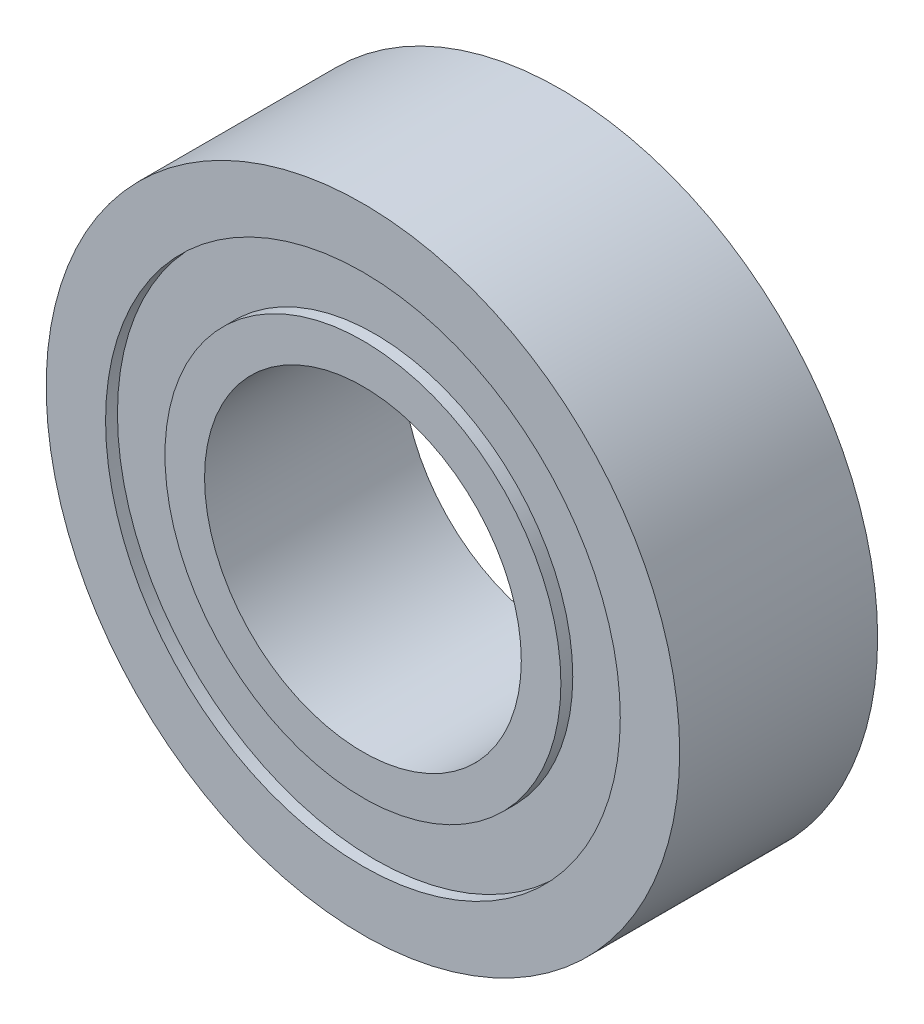
ISO-10303-21;
HEADER;
FILE_DESCRIPTION(('STEP AP214'),'2;1');
FILE_NAME('part.step','',(''),(''),'','','');
FILE_SCHEMA(('AUTOMOTIVE_DESIGN { 1 0 10303 214 1 1 1 1 }'));
ENDSEC;
DATA;
#1=APPLICATION_CONTEXT('core data for automotive mechanical design processes');
#2=APPLICATION_PROTOCOL_DEFINITION('international standard','automotive_design',2000,#1);
#3=PRODUCT_CONTEXT('',#1,'mechanical');
#4=PRODUCT('Part','Part','',(#3));
#5=PRODUCT_RELATED_PRODUCT_CATEGORY('part','',(#4));
#6=PRODUCT_DEFINITION_FORMATION('','',#4);
#7=PRODUCT_DEFINITION_CONTEXT('part definition',#1,'design');
#8=PRODUCT_DEFINITION('design','',#6,#7);
#9=PRODUCT_DEFINITION_SHAPE('','',#8);
#10=(LENGTH_UNIT() NAMED_UNIT(*) SI_UNIT(.MILLI.,.METRE.));
#11=(NAMED_UNIT(*) PLANE_ANGLE_UNIT() SI_UNIT($,.RADIAN.));
#12=(NAMED_UNIT(*) SI_UNIT($,.STERADIAN.) SOLID_ANGLE_UNIT());
#13=UNCERTAINTY_MEASURE_WITH_UNIT(LENGTH_MEASURE(1.E-05),#10,'distance_accuracy_value','');
#14=(GEOMETRIC_REPRESENTATION_CONTEXT(3) GLOBAL_UNCERTAINTY_ASSIGNED_CONTEXT((#13)) GLOBAL_UNIT_ASSIGNED_CONTEXT((#10,
#11,#12)) REPRESENTATION_CONTEXT('',''));
#15=CARTESIAN_POINT('',(0.,0.,0.));
#16=DIRECTION('',(0.,0.,1.));
#17=DIRECTION('',(1.,0.,0.));
#18=AXIS2_PLACEMENT_3D('',#15,#16,#17);
#19=CARTESIAN_POINT('',(0.,0.,-2.5));
#20=DIRECTION('',(0.,0.,1.));
#21=DIRECTION('',(1.,0.,0.));
#22=AXIS2_PLACEMENT_3D('',#19,#20,#21);
#23=PLANE('',#22);
#24=CARTESIAN_POINT('',(0.,0.,-2.5));
#25=DIRECTION('',(0.,0.,1.));
#26=DIRECTION('',(1.,0.,0.));
#27=AXIS2_PLACEMENT_3D('',#24,#25,#26);
#28=CIRCLE('',#27,4.);
#29=CARTESIAN_POINT('',(4.,0.,-2.5));
#30=VERTEX_POINT('',#29);
#31=EDGE_CURVE('E50',#30,#30,#28,.T.);
#32=ORIENTED_EDGE('',*,*,#31,.T.);
#33=EDGE_LOOP('',(#32));
#34=FACE_BOUND('',#33,.T.);
#35=CARTESIAN_POINT('',(0.,0.,-2.5));
#36=DIRECTION('',(0.,0.,1.));
#37=DIRECTION('',(1.,0.,0.));
#38=AXIS2_PLACEMENT_3D('',#35,#36,#37);
#39=CIRCLE('',#38,5.);
#40=CARTESIAN_POINT('',(5.,0.,-2.5));
#41=VERTEX_POINT('',#40);
#42=EDGE_CURVE('E87',#41,#41,#39,.T.);
#43=ORIENTED_EDGE('',*,*,#42,.F.);
#44=EDGE_LOOP('',(#43));
#45=FACE_BOUND('',#44,.T.);
#46=ADVANCED_FACE('F36',(#34,#45),#23,.F.);
#47=CARTESIAN_POINT('',(0.,0.,2.5));
#48=DIRECTION('',(0.,0.,1.));
#49=DIRECTION('',(1.,0.,0.));
#50=AXIS2_PLACEMENT_3D('',#47,#48,#49);
#51=PLANE('',#50);
#52=CARTESIAN_POINT('',(0.,0.,2.5));
#53=DIRECTION('',(0.,0.,1.));
#54=DIRECTION('',(1.,0.,0.));
#55=AXIS2_PLACEMENT_3D('',#52,#53,#54);
#56=CIRCLE('',#55,4.);
#57=CARTESIAN_POINT('',(4.,0.,2.5));
#58=VERTEX_POINT('',#57);
#59=EDGE_CURVE('E56',#58,#58,#56,.T.);
#60=ORIENTED_EDGE('',*,*,#59,.F.);
#61=EDGE_LOOP('',(#60));
#62=FACE_BOUND('',#61,.T.);
#63=CARTESIAN_POINT('',(0.,0.,2.5));
#64=DIRECTION('',(0.,0.,1.));
#65=DIRECTION('',(1.,0.,0.));
#66=AXIS2_PLACEMENT_3D('',#63,#64,#65);
#67=CIRCLE('',#66,5.);
#68=CARTESIAN_POINT('',(5.,0.,2.5));
#69=VERTEX_POINT('',#68);
#70=EDGE_CURVE('E71',#69,#69,#67,.T.);
#71=ORIENTED_EDGE('',*,*,#70,.T.);
#72=EDGE_LOOP('',(#71));
#73=FACE_BOUND('',#72,.T.);
#74=ADVANCED_FACE('F106',(#62,#73),#51,.T.);
#75=CARTESIAN_POINT('',(0.,0.,2.5));
#76=DIRECTION('',(0.,0.,-1.));
#77=DIRECTION('',(-1.,0.,0.));
#78=AXIS2_PLACEMENT_3D('',#75,#76,#77);
#79=CYLINDRICAL_SURFACE('',#78,8.);
#80=CARTESIAN_POINT('',(0.,0.,2.5));
#81=DIRECTION('',(0.,0.,1.));
#82=DIRECTION('',(1.,0.,0.));
#83=AXIS2_PLACEMENT_3D('',#80,#81,#82);
#84=CIRCLE('',#83,8.);
#85=CARTESIAN_POINT('',(8.,0.,2.5));
#86=VERTEX_POINT('',#85);
#87=EDGE_CURVE('E10',#86,#86,#84,.T.);
#88=ORIENTED_EDGE('',*,*,#87,.F.);
#89=EDGE_LOOP('',(#88));
#90=FACE_BOUND('',#89,.T.);
#91=CARTESIAN_POINT('',(0.,0.,-2.5));
#92=DIRECTION('',(0.,0.,1.));
#93=DIRECTION('',(1.,0.,0.));
#94=AXIS2_PLACEMENT_3D('',#91,#92,#93);
#95=CIRCLE('',#94,8.);
#96=CARTESIAN_POINT('',(8.,0.,-2.5));
#97=VERTEX_POINT('',#96);
#98=EDGE_CURVE('E44',#97,#97,#95,.T.);
#99=ORIENTED_EDGE('',*,*,#98,.T.);
#100=EDGE_LOOP('',(#99));
#101=FACE_BOUND('',#100,.T.);
#102=ADVANCED_FACE('F38',(#90,#101),#79,.T.);
#103=CARTESIAN_POINT('',(0.,0.,2.5));
#104=DIRECTION('',(0.,0.,1.));
#105=DIRECTION('',(1.,0.,0.));
#106=AXIS2_PLACEMENT_3D('',#103,#104,#105);
#107=CIRCLE('',#106,6.5);
#108=CARTESIAN_POINT('',(6.5,0.,2.5));
#109=VERTEX_POINT('',#108);
#110=EDGE_CURVE('E63',#109,#109,#107,.T.);
#111=ORIENTED_EDGE('',*,*,#110,.F.);
#112=EDGE_LOOP('',(#111));
#113=FACE_BOUND('',#112,.T.);
#114=ORIENTED_EDGE('',*,*,#87,.T.);
#115=EDGE_LOOP('',(#114));
#116=FACE_BOUND('',#115,.T.);
#117=ADVANCED_FACE('F114',(#113,#116),#51,.T.);
#118=CARTESIAN_POINT('',(0.,0.,-2.5));
#119=DIRECTION('',(0.,0.,1.));
#120=DIRECTION('',(1.,0.,0.));
#121=AXIS2_PLACEMENT_3D('',#118,#119,#120);
#122=CIRCLE('',#121,6.5);
#123=CARTESIAN_POINT('',(6.5,0.,-2.5));
#124=VERTEX_POINT('',#123);
#125=EDGE_CURVE('E79',#124,#124,#122,.T.);
#126=ORIENTED_EDGE('',*,*,#125,.T.);
#127=EDGE_LOOP('',(#126));
#128=FACE_BOUND('',#127,.T.);
#129=ORIENTED_EDGE('',*,*,#98,.F.);
#130=EDGE_LOOP('',(#129));
#131=FACE_BOUND('',#130,.T.);
#132=ADVANCED_FACE('F109',(#128,#131),#23,.F.);
#133=CARTESIAN_POINT('',(0.,0.,-2.5));
#134=DIRECTION('',(0.,0.,1.));
#135=DIRECTION('',(1.,0.,0.));
#136=AXIS2_PLACEMENT_3D('',#133,#134,#135);
#137=CYLINDRICAL_SURFACE('',#136,4.);
#138=ORIENTED_EDGE('',*,*,#31,.F.);
#139=EDGE_LOOP('',(#138));
#140=FACE_BOUND('',#139,.T.);
#141=ORIENTED_EDGE('',*,*,#59,.T.);
#142=EDGE_LOOP('',(#141));
#143=FACE_BOUND('',#142,.T.);
#144=ADVANCED_FACE('F117',(#140,#143),#137,.F.);
#145=CARTESIAN_POINT('',(0.,0.,2.2));
#146=DIRECTION('',(0.,0.,1.));
#147=DIRECTION('',(1.,0.,0.));
#148=AXIS2_PLACEMENT_3D('',#145,#146,#147);
#149=CYLINDRICAL_SURFACE('',#148,6.5);
#150=CARTESIAN_POINT('',(0.,0.,2.2));
#151=DIRECTION('',(0.,0.,1.));
#152=DIRECTION('',(1.,0.,0.));
#153=AXIS2_PLACEMENT_3D('',#150,#151,#152);
#154=CIRCLE('',#153,6.5);
#155=CARTESIAN_POINT('',(6.5,0.,2.2));
#156=VERTEX_POINT('',#155);
#157=EDGE_CURVE('E61',#156,#156,#154,.T.);
#158=ORIENTED_EDGE('',*,*,#157,.F.);
#159=EDGE_LOOP('',(#158));
#160=FACE_BOUND('',#159,.T.);
#161=ORIENTED_EDGE('',*,*,#110,.T.);
#162=EDGE_LOOP('',(#161));
#163=FACE_BOUND('',#162,.T.);
#164=ADVANCED_FACE('F123',(#160,#163),#149,.F.);
#165=CARTESIAN_POINT('',(0.,0.,2.2));
#166=DIRECTION('',(0.,0.,1.));
#167=DIRECTION('',(1.,0.,0.));
#168=AXIS2_PLACEMENT_3D('',#165,#166,#167);
#169=PLANE('',#168);
#170=CARTESIAN_POINT('',(0.,0.,2.2));
#171=DIRECTION('',(0.,0.,1.));
#172=DIRECTION('',(1.,0.,0.));
#173=AXIS2_PLACEMENT_3D('',#170,#171,#172);
#174=CIRCLE('',#173,5.);
#175=CARTESIAN_POINT('',(5.,0.,2.2));
#176=VERTEX_POINT('',#175);
#177=EDGE_CURVE('E67',#176,#176,#174,.T.);
#178=ORIENTED_EDGE('',*,*,#177,.F.);
#179=EDGE_LOOP('',(#178));
#180=FACE_BOUND('',#179,.T.);
#181=ORIENTED_EDGE('',*,*,#157,.T.);
#182=EDGE_LOOP('',(#181));
#183=FACE_BOUND('',#182,.T.);
#184=ADVANCED_FACE('F141',(#180,#183),#169,.T.);
#185=CARTESIAN_POINT('',(0.,0.,2.2));
#186=DIRECTION('',(0.,0.,1.));
#187=DIRECTION('',(1.,0.,0.));
#188=AXIS2_PLACEMENT_3D('',#185,#186,#187);
#189=CYLINDRICAL_SURFACE('',#188,5.);
#190=ORIENTED_EDGE('',*,*,#177,.T.);
#191=EDGE_LOOP('',(#190));
#192=FACE_BOUND('',#191,.T.);
#193=ORIENTED_EDGE('',*,*,#70,.F.);
#194=EDGE_LOOP('',(#193));
#195=FACE_BOUND('',#194,.T.);
#196=ADVANCED_FACE('F135',(#192,#195),#189,.T.);
#197=CARTESIAN_POINT('',(0.,0.,-2.2));
#198=DIRECTION('',(0.,0.,-1.));
#199=DIRECTION('',(1.,0.,0.));
#200=AXIS2_PLACEMENT_3D('',#197,#198,#199);
#201=PLANE('',#200);
#202=CARTESIAN_POINT('',(0.,0.,-2.2));
#203=DIRECTION('',(0.,0.,1.));
#204=DIRECTION('',(1.,0.,0.));
#205=AXIS2_PLACEMENT_3D('',#202,#203,#204);
#206=CIRCLE('',#205,6.5);
#207=CARTESIAN_POINT('',(6.5,0.,-2.2));
#208=VERTEX_POINT('',#207);
#209=EDGE_CURVE('E75',#208,#208,#206,.T.);
#210=ORIENTED_EDGE('',*,*,#209,.F.);
#211=EDGE_LOOP('',(#210));
#212=FACE_BOUND('',#211,.T.);
#213=CARTESIAN_POINT('',(0.,0.,-2.2));
#214=DIRECTION('',(0.,0.,1.));
#215=DIRECTION('',(1.,0.,0.));
#216=AXIS2_PLACEMENT_3D('',#213,#214,#215);
#217=CIRCLE('',#216,5.);
#218=CARTESIAN_POINT('',(5.,0.,-2.2));
#219=VERTEX_POINT('',#218);
#220=EDGE_CURVE('E83',#219,#219,#217,.T.);
#221=ORIENTED_EDGE('',*,*,#220,.T.);
#222=EDGE_LOOP('',(#221));
#223=FACE_BOUND('',#222,.T.);
#224=ADVANCED_FACE('F96',(#212,#223),#201,.T.);
#225=CARTESIAN_POINT('',(0.,0.,-2.2));
#226=DIRECTION('',(0.,0.,-1.));
#227=DIRECTION('',(-1.,0.,0.));
#228=AXIS2_PLACEMENT_3D('',#225,#226,#227);
#229=CYLINDRICAL_SURFACE('',#228,6.5);
#230=ORIENTED_EDGE('',*,*,#209,.T.);
#231=EDGE_LOOP('',(#230));
#232=FACE_BOUND('',#231,.T.);
#233=ORIENTED_EDGE('',*,*,#125,.F.);
#234=EDGE_LOOP('',(#233));
#235=FACE_BOUND('',#234,.T.);
#236=ADVANCED_FACE('F101',(#232,#235),#229,.F.);
#237=CARTESIAN_POINT('',(0.,0.,-2.2));
#238=DIRECTION('',(0.,0.,-1.));
#239=DIRECTION('',(-1.,0.,0.));
#240=AXIS2_PLACEMENT_3D('',#237,#238,#239);
#241=CYLINDRICAL_SURFACE('',#240,5.);
#242=ORIENTED_EDGE('',*,*,#220,.F.);
#243=EDGE_LOOP('',(#242));
#244=FACE_BOUND('',#243,.T.);
#245=ORIENTED_EDGE('',*,*,#42,.T.);
#246=EDGE_LOOP('',(#245));
#247=FACE_BOUND('',#246,.T.);
#248=ADVANCED_FACE('F98',(#244,#247),#241,.T.);
#249=CLOSED_SHELL('',(#46,#74,#102,#117,#132,#144,#164,#184,#196,#224,#236,#248));
#250=MANIFOLD_SOLID_BREP('B2',#249);
#251=ADVANCED_BREP_SHAPE_REPRESENTATION('',(#18,#250),#14);
#252=SHAPE_DEFINITION_REPRESENTATION(#9,#251);
ENDSEC;
END-ISO-10303-21;
